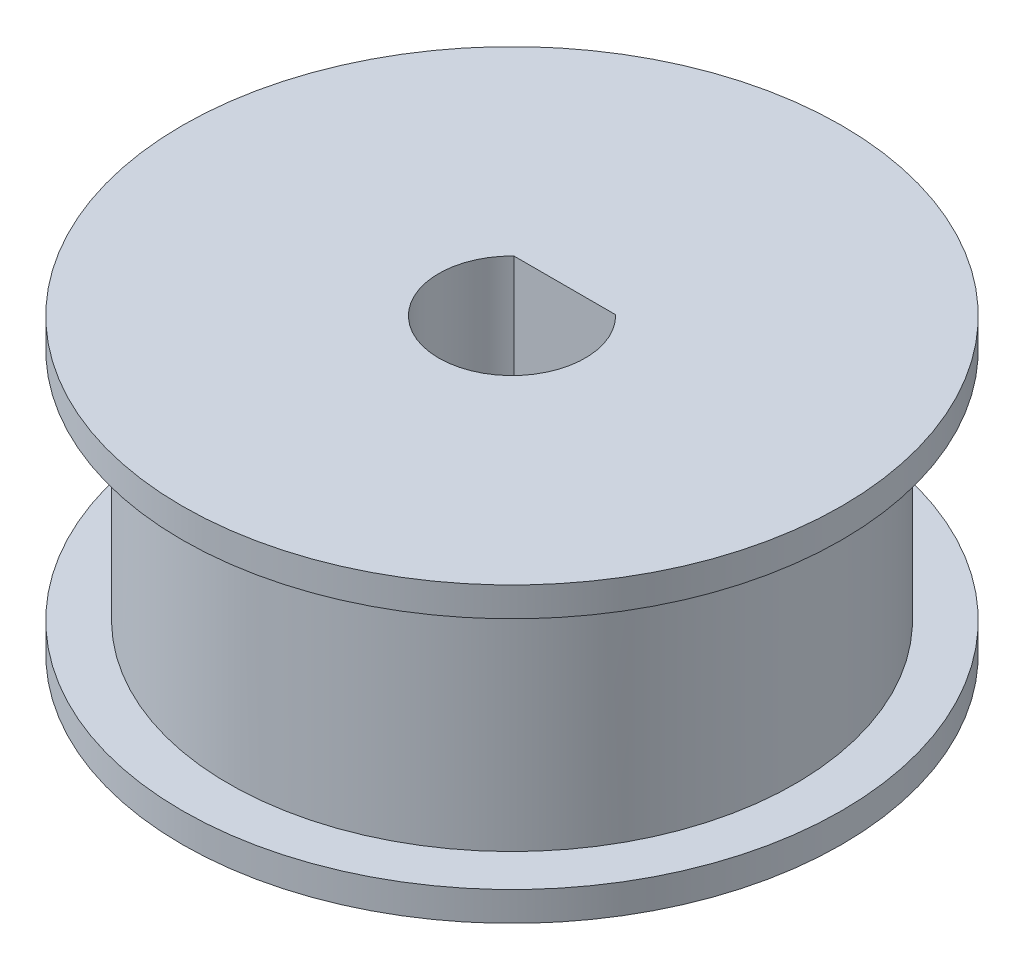
ISO-10303-21;
HEADER;
FILE_DESCRIPTION(('STEP AP214'),'2;1');
FILE_NAME('part.step','',(''),(''),'','','');
FILE_SCHEMA(('AUTOMOTIVE_DESIGN { 1 0 10303 214 1 1 1 1 }'));
ENDSEC;
DATA;
#1=APPLICATION_CONTEXT('core data for automotive mechanical design processes');
#2=APPLICATION_PROTOCOL_DEFINITION('international standard','automotive_design',2000,#1);
#3=PRODUCT_CONTEXT('',#1,'mechanical');
#4=PRODUCT('Part','Part','',(#3));
#5=PRODUCT_RELATED_PRODUCT_CATEGORY('part','',(#4));
#6=PRODUCT_DEFINITION_FORMATION('','',#4);
#7=PRODUCT_DEFINITION_CONTEXT('part definition',#1,'design');
#8=PRODUCT_DEFINITION('design','',#6,#7);
#9=PRODUCT_DEFINITION_SHAPE('','',#8);
#10=(LENGTH_UNIT() NAMED_UNIT(*) SI_UNIT(.MILLI.,.METRE.));
#11=(NAMED_UNIT(*) PLANE_ANGLE_UNIT() SI_UNIT($,.RADIAN.));
#12=(NAMED_UNIT(*) SI_UNIT($,.STERADIAN.) SOLID_ANGLE_UNIT());
#13=UNCERTAINTY_MEASURE_WITH_UNIT(LENGTH_MEASURE(1.E-05),#10,'distance_accuracy_value','');
#14=(GEOMETRIC_REPRESENTATION_CONTEXT(3) GLOBAL_UNCERTAINTY_ASSIGNED_CONTEXT((#13)) GLOBAL_UNIT_ASSIGNED_CONTEXT((#10,
#11,#12)) REPRESENTATION_CONTEXT('',''));
#15=CARTESIAN_POINT('',(0.,0.,0.));
#16=DIRECTION('',(0.,0.,1.));
#17=DIRECTION('',(1.,0.,0.));
#18=AXIS2_PLACEMENT_3D('',#15,#16,#17);
#19=CARTESIAN_POINT('',(0.,16.,0.));
#20=DIRECTION('',(0.,-1.,0.));
#21=DIRECTION('',(0.,0.,-1.));
#22=AXIS2_PLACEMENT_3D('',#19,#20,#21);
#23=CYLINDRICAL_SURFACE('',#22,19.325);
#24=CARTESIAN_POINT('',(0.,16.,0.));
#25=DIRECTION('',(0.,1.,0.));
#26=DIRECTION('',(0.,0.,1.));
#27=AXIS2_PLACEMENT_3D('',#24,#25,#26);
#28=CIRCLE('',#27,19.325);
#29=CARTESIAN_POINT('',(0.,16.,19.325));
#30=VERTEX_POINT('',#29);
#31=EDGE_CURVE('E11',#30,#30,#28,.T.);
#32=ORIENTED_EDGE('',*,*,#31,.F.);
#33=EDGE_LOOP('',(#32));
#34=FACE_BOUND('',#33,.T.);
#35=CARTESIAN_POINT('',(0.,0.,0.));
#36=DIRECTION('',(0.,-1.,0.));
#37=DIRECTION('',(0.,0.,-1.));
#38=AXIS2_PLACEMENT_3D('',#35,#36,#37);
#39=CIRCLE('',#38,19.325);
#40=CARTESIAN_POINT('',(0.,0.,-19.325));
#41=VERTEX_POINT('',#40);
#42=EDGE_CURVE('E96',#41,#41,#39,.T.);
#43=ORIENTED_EDGE('',*,*,#42,.F.);
#44=EDGE_LOOP('',(#43));
#45=FACE_BOUND('',#44,.T.);
#46=ADVANCED_FACE('F38',(#34,#45),#23,.T.);
#47=CARTESIAN_POINT('',(0.,16.,0.));
#48=DIRECTION('',(0.,1.,0.));
#49=DIRECTION('',(0.,0.,1.));
#50=AXIS2_PLACEMENT_3D('',#47,#48,#49);
#51=PLANE('',#50);
#52=CARTESIAN_POINT('',(0.,16.,0.));
#53=DIRECTION('',(0.,1.,0.));
#54=DIRECTION('',(0.,0.,1.));
#55=AXIS2_PLACEMENT_3D('',#52,#53,#54);
#56=CIRCLE('',#55,22.5);
#57=CARTESIAN_POINT('',(0.,16.,22.5));
#58=VERTEX_POINT('',#57);
#59=EDGE_CURVE('E102',#58,#58,#56,.T.);
#60=ORIENTED_EDGE('',*,*,#59,.F.);
#61=EDGE_LOOP('',(#60));
#62=FACE_BOUND('',#61,.T.);
#63=ORIENTED_EDGE('',*,*,#31,.T.);
#64=EDGE_LOOP('',(#63));
#65=FACE_BOUND('',#64,.T.);
#66=ADVANCED_FACE('F111',(#62,#65),#51,.F.);
#67=CARTESIAN_POINT('',(0.,18.,0.));
#68=DIRECTION('',(0.,1.,0.));
#69=DIRECTION('',(0.,0.,1.));
#70=AXIS2_PLACEMENT_3D('',#67,#68,#69);
#71=PLANE('',#70);
#72=CARTESIAN_POINT('',(0.,18.,0.));
#73=DIRECTION('',(0.,1.,0.));
#74=DIRECTION('',(0.,0.,1.));
#75=AXIS2_PLACEMENT_3D('',#72,#73,#74);
#76=CIRCLE('',#75,5.);
#77=CARTESIAN_POINT('',(-3.46987031457949,18.,-3.6));
#78=VERTEX_POINT('',#77);
#79=CARTESIAN_POINT('',(3.46987031457949,18.,-3.6));
#80=VERTEX_POINT('',#79);
#81=EDGE_CURVE('E53',#78,#80,#76,.T.);
#82=ORIENTED_EDGE('',*,*,#81,.F.);
#83=DIRECTION('',(-1.,0.,0.));
#84=VECTOR('',#83,1.);
#85=CARTESIAN_POINT('',(-3.46987031457949,18.,-3.6));
#86=LINE('',#85,#84);
#87=EDGE_CURVE('E78',#80,#78,#86,.T.);
#88=ORIENTED_EDGE('',*,*,#87,.F.);
#89=EDGE_LOOP('',(#82,#88));
#90=FACE_BOUND('',#89,.T.);
#91=CARTESIAN_POINT('',(0.,18.,0.));
#92=DIRECTION('',(0.,1.,0.));
#93=DIRECTION('',(0.,0.,1.));
#94=AXIS2_PLACEMENT_3D('',#91,#92,#93);
#95=CIRCLE('',#94,22.5);
#96=CARTESIAN_POINT('',(0.,18.,22.5));
#97=VERTEX_POINT('',#96);
#98=EDGE_CURVE('E46',#97,#97,#95,.T.);
#99=ORIENTED_EDGE('',*,*,#98,.T.);
#100=EDGE_LOOP('',(#99));
#101=FACE_BOUND('',#100,.T.);
#102=ADVANCED_FACE('F114',(#90,#101),#71,.T.);
#103=CARTESIAN_POINT('',(0.,18.,0.));
#104=DIRECTION('',(0.,-1.,0.));
#105=DIRECTION('',(0.,0.,-1.));
#106=AXIS2_PLACEMENT_3D('',#103,#104,#105);
#107=CYLINDRICAL_SURFACE('',#106,22.5);
#108=ORIENTED_EDGE('',*,*,#98,.F.);
#109=EDGE_LOOP('',(#108));
#110=FACE_BOUND('',#109,.T.);
#111=ORIENTED_EDGE('',*,*,#59,.T.);
#112=EDGE_LOOP('',(#111));
#113=FACE_BOUND('',#112,.T.);
#114=ADVANCED_FACE('F109',(#110,#113),#107,.T.);
#115=CARTESIAN_POINT('',(0.,0.,0.));
#116=DIRECTION('',(0.,-1.,0.));
#117=DIRECTION('',(0.,0.,-1.));
#118=AXIS2_PLACEMENT_3D('',#115,#116,#117);
#119=PLANE('',#118);
#120=CARTESIAN_POINT('',(0.,0.,0.));
#121=DIRECTION('',(0.,-1.,0.));
#122=DIRECTION('',(0.,0.,-1.));
#123=AXIS2_PLACEMENT_3D('',#120,#121,#122);
#124=CIRCLE('',#123,22.5);
#125=CARTESIAN_POINT('',(0.,0.,-22.5));
#126=VERTEX_POINT('',#125);
#127=EDGE_CURVE('E73',#126,#126,#124,.T.);
#128=ORIENTED_EDGE('',*,*,#127,.F.);
#129=EDGE_LOOP('',(#128));
#130=FACE_BOUND('',#129,.T.);
#131=ORIENTED_EDGE('',*,*,#42,.T.);
#132=EDGE_LOOP('',(#131));
#133=FACE_BOUND('',#132,.T.);
#134=ADVANCED_FACE('F122',(#130,#133),#119,.F.);
#135=CARTESIAN_POINT('',(0.,-2.,0.));
#136=DIRECTION('',(0.,-1.,0.));
#137=DIRECTION('',(0.,0.,-1.));
#138=AXIS2_PLACEMENT_3D('',#135,#136,#137);
#139=PLANE('',#138);
#140=CARTESIAN_POINT('',(0.,-2.,0.));
#141=DIRECTION('',(0.,-1.,0.));
#142=DIRECTION('',(0.,0.,-1.));
#143=AXIS2_PLACEMENT_3D('',#140,#141,#142);
#144=CIRCLE('',#143,5.);
#145=CARTESIAN_POINT('',(-3.46987031457949,-2.,-3.6));
#146=VERTEX_POINT('',#145);
#147=CARTESIAN_POINT('',(3.4698703145795,-2.,-3.6));
#148=VERTEX_POINT('',#147);
#149=EDGE_CURVE('E76',#146,#148,#144,.F.);
#150=ORIENTED_EDGE('',*,*,#149,.T.);
#151=DIRECTION('',(-1.,0.,0.));
#152=VECTOR('',#151,1.);
#153=CARTESIAN_POINT('',(-3.46987031457949,-2.,-3.6));
#154=LINE('',#153,#152);
#155=EDGE_CURVE('E66',#148,#146,#154,.T.);
#156=ORIENTED_EDGE('',*,*,#155,.T.);
#157=EDGE_LOOP('',(#150,#156));
#158=FACE_BOUND('',#157,.T.);
#159=CARTESIAN_POINT('',(0.,-2.,0.));
#160=DIRECTION('',(0.,-1.,0.));
#161=DIRECTION('',(0.,0.,-1.));
#162=AXIS2_PLACEMENT_3D('',#159,#160,#161);
#163=CIRCLE('',#162,22.5);
#164=CARTESIAN_POINT('',(0.,-2.,-22.5));
#165=VERTEX_POINT('',#164);
#166=EDGE_CURVE('E92',#165,#165,#163,.T.);
#167=ORIENTED_EDGE('',*,*,#166,.T.);
#168=EDGE_LOOP('',(#167));
#169=FACE_BOUND('',#168,.T.);
#170=ADVANCED_FACE('F80',(#158,#169),#139,.T.);
#171=CARTESIAN_POINT('',(0.,-2.,0.));
#172=DIRECTION('',(0.,1.,0.));
#173=DIRECTION('',(0.,0.,1.));
#174=AXIS2_PLACEMENT_3D('',#171,#172,#173);
#175=CYLINDRICAL_SURFACE('',#174,22.5);
#176=ORIENTED_EDGE('',*,*,#166,.F.);
#177=EDGE_LOOP('',(#176));
#178=FACE_BOUND('',#177,.T.);
#179=ORIENTED_EDGE('',*,*,#127,.T.);
#180=EDGE_LOOP('',(#179));
#181=FACE_BOUND('',#180,.T.);
#182=ADVANCED_FACE('F130',(#178,#181),#175,.T.);
#183=CARTESIAN_POINT('',(0.,-2.001,0.));
#184=DIRECTION('',(0.,1.,0.));
#185=DIRECTION('',(0.,0.,1.));
#186=AXIS2_PLACEMENT_3D('',#183,#184,#185);
#187=CYLINDRICAL_SURFACE('',#186,5.);
#188=DIRECTION('',(0.,1.,0.));
#189=VECTOR('',#188,1.);
#190=CARTESIAN_POINT('',(-3.46987031457949,-2.001,-3.6));
#191=LINE('',#190,#189);
#192=EDGE_CURVE('E60',#146,#78,#191,.T.);
#193=ORIENTED_EDGE('',*,*,#192,.T.);
#194=ORIENTED_EDGE('',*,*,#81,.T.);
#195=DIRECTION('',(0.,1.,0.));
#196=VECTOR('',#195,1.);
#197=CARTESIAN_POINT('',(3.46987031457949,-2.001,-3.6));
#198=LINE('',#197,#196);
#199=EDGE_CURVE('E68',#148,#80,#198,.T.);
#200=ORIENTED_EDGE('',*,*,#199,.F.);
#201=ORIENTED_EDGE('',*,*,#149,.F.);
#202=EDGE_LOOP('',(#193,#194,#200,#201));
#203=FACE_BOUND('',#202,.T.);
#204=ADVANCED_FACE('F75',(#203),#187,.F.);
#205=CARTESIAN_POINT('',(-3.46987031457949,-2.001,-3.6));
#206=DIRECTION('',(0.,0.,-1.));
#207=DIRECTION('',(-1.,0.,0.));
#208=AXIS2_PLACEMENT_3D('',#205,#206,#207);
#209=PLANE('',#208);
#210=ORIENTED_EDGE('',*,*,#199,.T.);
#211=ORIENTED_EDGE('',*,*,#87,.T.);
#212=ORIENTED_EDGE('',*,*,#192,.F.);
#213=ORIENTED_EDGE('',*,*,#155,.F.);
#214=EDGE_LOOP('',(#210,#211,#212,#213));
#215=FACE_BOUND('',#214,.T.);
#216=ADVANCED_FACE('F67',(#215),#209,.F.);
#217=CLOSED_SHELL('',(#46,#66,#102,#114,#134,#170,#182,#204,#216));
#218=MANIFOLD_SOLID_BREP('B2',#217);
#219=ADVANCED_BREP_SHAPE_REPRESENTATION('',(#18,#218),#14);
#220=SHAPE_DEFINITION_REPRESENTATION(#9,#219);
ENDSEC;
END-ISO-10303-21;
